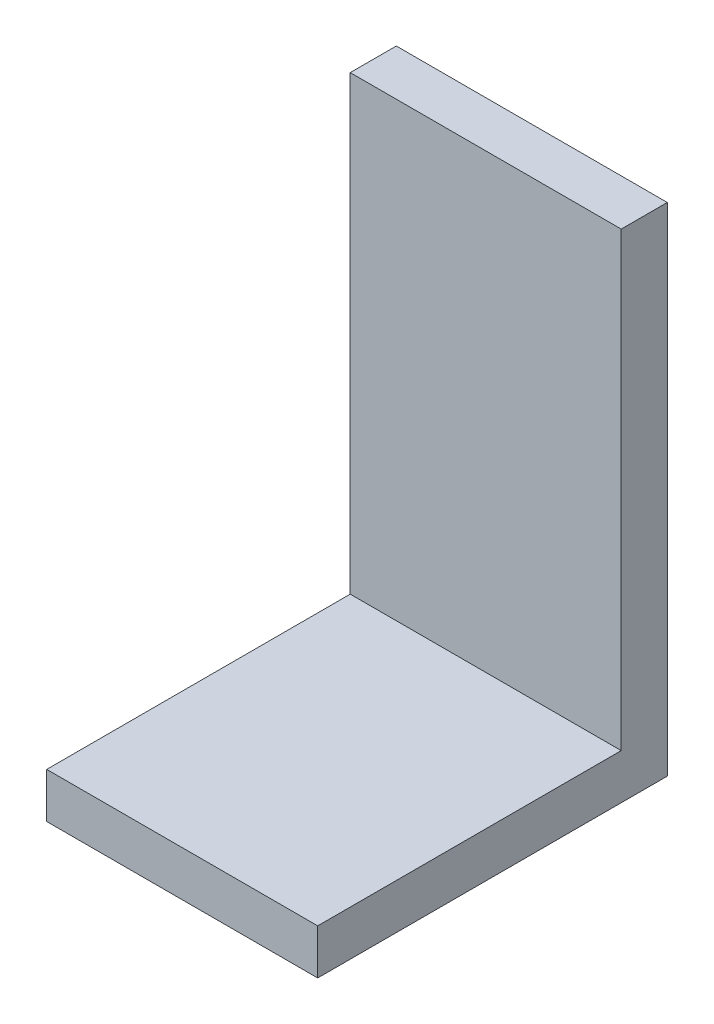
ISO-10303-21;
HEADER;
FILE_DESCRIPTION(('STEP AP214'),'2;1');
FILE_NAME('part.step','',(''),(''),'','','');
FILE_SCHEMA(('AUTOMOTIVE_DESIGN { 1 0 10303 214 1 1 1 1 }'));
ENDSEC;
DATA;
#1=APPLICATION_CONTEXT('core data for automotive mechanical design processes');
#2=APPLICATION_PROTOCOL_DEFINITION('international standard','automotive_design',2000,#1);
#3=PRODUCT_CONTEXT('',#1,'mechanical');
#4=PRODUCT('Part','Part','',(#3));
#5=PRODUCT_RELATED_PRODUCT_CATEGORY('part','',(#4));
#6=PRODUCT_DEFINITION_FORMATION('','',#4);
#7=PRODUCT_DEFINITION_CONTEXT('part definition',#1,'design');
#8=PRODUCT_DEFINITION('design','',#6,#7);
#9=PRODUCT_DEFINITION_SHAPE('','',#8);
#10=(LENGTH_UNIT() NAMED_UNIT(*) SI_UNIT(.MILLI.,.METRE.));
#11=(NAMED_UNIT(*) PLANE_ANGLE_UNIT() SI_UNIT($,.RADIAN.));
#12=(NAMED_UNIT(*) SI_UNIT($,.STERADIAN.) SOLID_ANGLE_UNIT());
#13=UNCERTAINTY_MEASURE_WITH_UNIT(LENGTH_MEASURE(1.E-05),#10,'distance_accuracy_value','');
#14=(GEOMETRIC_REPRESENTATION_CONTEXT(3) GLOBAL_UNCERTAINTY_ASSIGNED_CONTEXT((#13)) GLOBAL_UNIT_ASSIGNED_CONTEXT((#10,
#11,#12)) REPRESENTATION_CONTEXT('',''));
#15=CARTESIAN_POINT('',(0.,0.,0.));
#16=DIRECTION('',(0.,0.,1.));
#17=DIRECTION('',(1.,0.,0.));
#18=AXIS2_PLACEMENT_3D('',#15,#16,#17);
#19=CARTESIAN_POINT('',(2.4,-4.55,0.));
#20=DIRECTION('',(1.,0.,0.));
#21=DIRECTION('',(0.,0.,1.));
#22=AXIS2_PLACEMENT_3D('',#19,#20,#21);
#23=PLANE('',#22);
#24=DIRECTION('',(0.,-1.,0.));
#25=VECTOR('',#24,1.);
#26=CARTESIAN_POINT('',(2.4,-4.,0.));
#27=LINE('',#26,#25);
#28=CARTESIAN_POINT('',(2.4,-4.,0.));
#29=VERTEX_POINT('',#28);
#30=CARTESIAN_POINT('',(2.4,-4.55,0.));
#31=VERTEX_POINT('',#30);
#32=EDGE_CURVE('E11',#29,#31,#27,.T.);
#33=ORIENTED_EDGE('',*,*,#32,.F.);
#34=DIRECTION('',(0.,0.,-1.));
#35=VECTOR('',#34,1.);
#36=CARTESIAN_POINT('',(2.4,-4.,0.051));
#37=LINE('',#36,#35);
#38=CARTESIAN_POINT('',(2.4,-4.,0.051));
#39=VERTEX_POINT('',#38);
#40=EDGE_CURVE('E24',#39,#29,#37,.T.);
#41=ORIENTED_EDGE('',*,*,#40,.F.);
#42=DIRECTION('',(0.,1.,0.));
#43=VECTOR('',#42,1.);
#44=CARTESIAN_POINT('',(2.4,-4.5,0.051));
#45=LINE('',#44,#43);
#46=CARTESIAN_POINT('',(2.4,-4.5,0.051));
#47=VERTEX_POINT('',#46);
#48=EDGE_CURVE('E87',#47,#39,#45,.T.);
#49=ORIENTED_EDGE('',*,*,#48,.F.);
#50=DIRECTION('',(0.,0.,-1.));
#51=VECTOR('',#50,1.);
#52=CARTESIAN_POINT('',(2.4,-4.5,0.387));
#53=LINE('',#52,#51);
#54=CARTESIAN_POINT('',(2.4,-4.5,0.387));
#55=VERTEX_POINT('',#54);
#56=EDGE_CURVE('E114',#55,#47,#53,.T.);
#57=ORIENTED_EDGE('',*,*,#56,.F.);
#58=DIRECTION('',(0.,1.,0.));
#59=VECTOR('',#58,1.);
#60=CARTESIAN_POINT('',(2.4,-4.55,0.387));
#61=LINE('',#60,#59);
#62=CARTESIAN_POINT('',(2.4,-4.55,0.387));
#63=VERTEX_POINT('',#62);
#64=EDGE_CURVE('E111',#63,#55,#61,.T.);
#65=ORIENTED_EDGE('',*,*,#64,.F.);
#66=DIRECTION('',(0.,0.,1.));
#67=VECTOR('',#66,1.);
#68=CARTESIAN_POINT('',(2.4,-4.55,0.));
#69=LINE('',#68,#67);
#70=EDGE_CURVE('E108',#31,#63,#69,.T.);
#71=ORIENTED_EDGE('',*,*,#70,.F.);
#72=EDGE_LOOP('',(#33,#41,#49,#57,#65,#71));
#73=FACE_BOUND('',#72,.T.);
#74=ADVANCED_FACE('F17',(#73),#23,.T.);
#75=CARTESIAN_POINT('',(2.1,-4.,0.));
#76=DIRECTION('',(-1.,0.,0.));
#77=DIRECTION('',(0.,0.,1.));
#78=AXIS2_PLACEMENT_3D('',#75,#76,#77);
#79=PLANE('',#78);
#80=DIRECTION('',(0.,1.,0.));
#81=VECTOR('',#80,1.);
#82=CARTESIAN_POINT('',(2.1,-4.55,0.));
#83=LINE('',#82,#81);
#84=CARTESIAN_POINT('',(2.1,-4.55,0.));
#85=VERTEX_POINT('',#84);
#86=CARTESIAN_POINT('',(2.1,-4.,0.));
#87=VERTEX_POINT('',#86);
#88=EDGE_CURVE('E106',#85,#87,#83,.T.);
#89=ORIENTED_EDGE('',*,*,#88,.F.);
#90=DIRECTION('',(0.,0.,-1.));
#91=VECTOR('',#90,1.);
#92=CARTESIAN_POINT('',(2.1,-4.55,0.387));
#93=LINE('',#92,#91);
#94=CARTESIAN_POINT('',(2.1,-4.55,0.387));
#95=VERTEX_POINT('',#94);
#96=EDGE_CURVE('E103',#95,#85,#93,.T.);
#97=ORIENTED_EDGE('',*,*,#96,.F.);
#98=DIRECTION('',(0.,-1.,0.));
#99=VECTOR('',#98,1.);
#100=CARTESIAN_POINT('',(2.1,-4.5,0.387));
#101=LINE('',#100,#99);
#102=CARTESIAN_POINT('',(2.1,-4.5,0.387));
#103=VERTEX_POINT('',#102);
#104=EDGE_CURVE('E100',#103,#95,#101,.T.);
#105=ORIENTED_EDGE('',*,*,#104,.F.);
#106=DIRECTION('',(0.,0.,1.));
#107=VECTOR('',#106,1.);
#108=CARTESIAN_POINT('',(2.1,-4.5,0.051));
#109=LINE('',#108,#107);
#110=CARTESIAN_POINT('',(2.1,-4.5,0.051));
#111=VERTEX_POINT('',#110);
#112=EDGE_CURVE('E72',#111,#103,#109,.T.);
#113=ORIENTED_EDGE('',*,*,#112,.F.);
#114=DIRECTION('',(0.,-1.,0.));
#115=VECTOR('',#114,1.);
#116=CARTESIAN_POINT('',(2.1,-4.,0.051));
#117=LINE('',#116,#115);
#118=CARTESIAN_POINT('',(2.1,-4.,0.051));
#119=VERTEX_POINT('',#118);
#120=EDGE_CURVE('E66',#119,#111,#117,.T.);
#121=ORIENTED_EDGE('',*,*,#120,.F.);
#122=DIRECTION('',(0.,0.,1.));
#123=VECTOR('',#122,1.);
#124=CARTESIAN_POINT('',(2.1,-4.,0.));
#125=LINE('',#124,#123);
#126=EDGE_CURVE('E69',#87,#119,#125,.T.);
#127=ORIENTED_EDGE('',*,*,#126,.F.);
#128=EDGE_LOOP('',(#89,#97,#105,#113,#121,#127));
#129=FACE_BOUND('',#128,.T.);
#130=ADVANCED_FACE('F68',(#129),#79,.T.);
#131=CARTESIAN_POINT('',(2.4,-4.55,0.387));
#132=DIRECTION('',(0.,0.,1.));
#133=DIRECTION('',(0.,1.,0.));
#134=AXIS2_PLACEMENT_3D('',#131,#132,#133);
#135=PLANE('',#134);
#136=ORIENTED_EDGE('',*,*,#64,.T.);
#137=DIRECTION('',(1.,0.,0.));
#138=VECTOR('',#137,1.);
#139=CARTESIAN_POINT('',(2.1,-4.5,0.387));
#140=LINE('',#139,#138);
#141=EDGE_CURVE('E83',#103,#55,#140,.T.);
#142=ORIENTED_EDGE('',*,*,#141,.F.);
#143=ORIENTED_EDGE('',*,*,#104,.T.);
#144=DIRECTION('',(-1.,0.,0.));
#145=VECTOR('',#144,1.);
#146=CARTESIAN_POINT('',(2.4,-4.55,0.387));
#147=LINE('',#146,#145);
#148=EDGE_CURVE('E88',#63,#95,#147,.T.);
#149=ORIENTED_EDGE('',*,*,#148,.F.);
#150=EDGE_LOOP('',(#136,#142,#143,#149));
#151=FACE_BOUND('',#150,.T.);
#152=ADVANCED_FACE('F125',(#151),#135,.T.);
#153=CARTESIAN_POINT('',(2.4,-4.5,0.051));
#154=DIRECTION('',(0.,0.,1.));
#155=DIRECTION('',(0.,1.,0.));
#156=AXIS2_PLACEMENT_3D('',#153,#154,#155);
#157=PLANE('',#156);
#158=ORIENTED_EDGE('',*,*,#48,.T.);
#159=DIRECTION('',(1.,0.,0.));
#160=VECTOR('',#159,1.);
#161=CARTESIAN_POINT('',(2.1,-4.,0.051));
#162=LINE('',#161,#160);
#163=EDGE_CURVE('E81',#119,#39,#162,.T.);
#164=ORIENTED_EDGE('',*,*,#163,.F.);
#165=ORIENTED_EDGE('',*,*,#120,.T.);
#166=DIRECTION('',(-1.,0.,0.));
#167=VECTOR('',#166,1.);
#168=CARTESIAN_POINT('',(2.4,-4.5,0.051));
#169=LINE('',#168,#167);
#170=EDGE_CURVE('E89',#47,#111,#169,.T.);
#171=ORIENTED_EDGE('',*,*,#170,.F.);
#172=EDGE_LOOP('',(#158,#164,#165,#171));
#173=FACE_BOUND('',#172,.T.);
#174=ADVANCED_FACE('F86',(#173),#157,.T.);
#175=CARTESIAN_POINT('',(2.1,-4.55,0.));
#176=DIRECTION('',(0.,-1.,0.));
#177=DIRECTION('',(0.,0.,1.));
#178=AXIS2_PLACEMENT_3D('',#175,#176,#177);
#179=PLANE('',#178);
#180=DIRECTION('',(-1.,0.,0.));
#181=VECTOR('',#180,1.);
#182=CARTESIAN_POINT('',(2.4,-4.55,0.));
#183=LINE('',#182,#181);
#184=EDGE_CURVE('E93',#31,#85,#183,.T.);
#185=ORIENTED_EDGE('',*,*,#184,.F.);
#186=ORIENTED_EDGE('',*,*,#70,.T.);
#187=ORIENTED_EDGE('',*,*,#148,.T.);
#188=ORIENTED_EDGE('',*,*,#96,.T.);
#189=EDGE_LOOP('',(#185,#186,#187,#188));
#190=FACE_BOUND('',#189,.T.);
#191=ADVANCED_FACE('F121',(#190),#179,.T.);
#192=CARTESIAN_POINT('',(2.4,-4.,0.));
#193=DIRECTION('',(0.,1.,0.));
#194=DIRECTION('',(0.,0.,1.));
#195=AXIS2_PLACEMENT_3D('',#192,#193,#194);
#196=PLANE('',#195);
#197=DIRECTION('',(1.,0.,0.));
#198=VECTOR('',#197,1.);
#199=CARTESIAN_POINT('',(2.1,-4.,0.));
#200=LINE('',#199,#198);
#201=EDGE_CURVE('E82',#87,#29,#200,.T.);
#202=ORIENTED_EDGE('',*,*,#201,.F.);
#203=ORIENTED_EDGE('',*,*,#126,.T.);
#204=ORIENTED_EDGE('',*,*,#163,.T.);
#205=ORIENTED_EDGE('',*,*,#40,.T.);
#206=EDGE_LOOP('',(#202,#203,#204,#205));
#207=FACE_BOUND('',#206,.T.);
#208=ADVANCED_FACE('F80',(#207),#196,.T.);
#209=CARTESIAN_POINT('',(2.4,-4.5,0.051));
#210=DIRECTION('',(0.,1.,0.));
#211=DIRECTION('',(0.,0.,1.));
#212=AXIS2_PLACEMENT_3D('',#209,#210,#211);
#213=PLANE('',#212);
#214=ORIENTED_EDGE('',*,*,#170,.T.);
#215=ORIENTED_EDGE('',*,*,#112,.T.);
#216=ORIENTED_EDGE('',*,*,#141,.T.);
#217=ORIENTED_EDGE('',*,*,#56,.T.);
#218=EDGE_LOOP('',(#214,#215,#216,#217));
#219=FACE_BOUND('',#218,.T.);
#220=ADVANCED_FACE('F127',(#219),#213,.T.);
#221=CARTESIAN_POINT('',(2.1,-4.55,0.));
#222=DIRECTION('',(0.,0.,-1.));
#223=DIRECTION('',(0.,1.,0.));
#224=AXIS2_PLACEMENT_3D('',#221,#222,#223);
#225=PLANE('',#224);
#226=ORIENTED_EDGE('',*,*,#88,.T.);
#227=ORIENTED_EDGE('',*,*,#201,.T.);
#228=ORIENTED_EDGE('',*,*,#32,.T.);
#229=ORIENTED_EDGE('',*,*,#184,.T.);
#230=EDGE_LOOP('',(#226,#227,#228,#229));
#231=FACE_BOUND('',#230,.T.);
#232=ADVANCED_FACE('F117',(#231),#225,.T.);
#233=CLOSED_SHELL('',(#74,#130,#152,#174,#191,#208,#220,#232));
#234=MANIFOLD_SOLID_BREP('B1',#233);
#235=ADVANCED_BREP_SHAPE_REPRESENTATION('',(#18,#234),#14);
#236=SHAPE_DEFINITION_REPRESENTATION(#9,#235);
ENDSEC;
END-ISO-10303-21;
